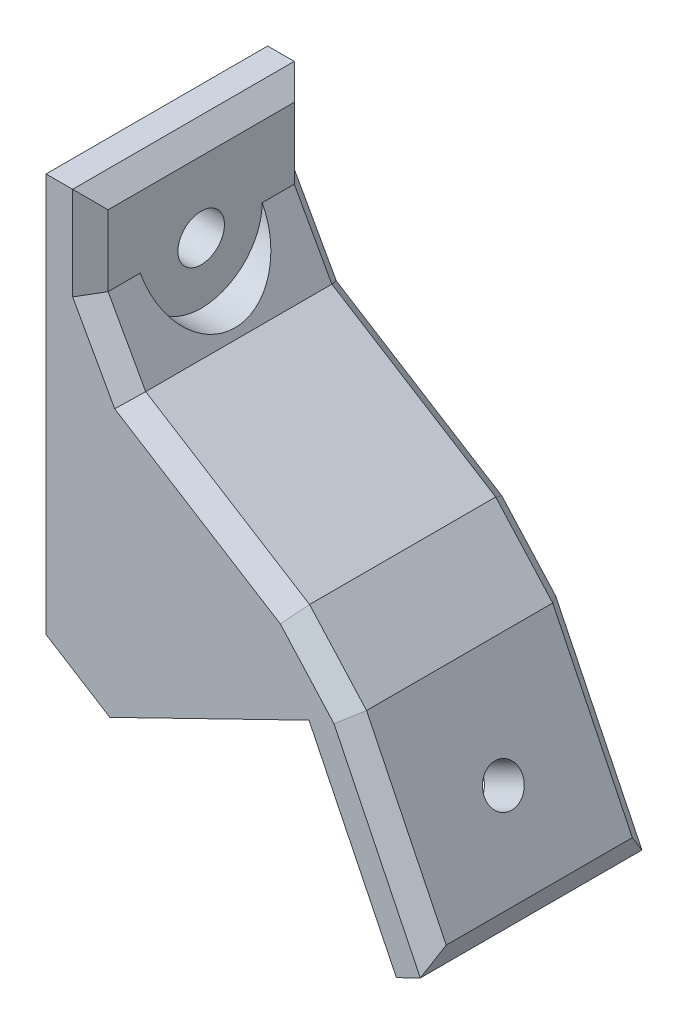
ISO-10303-21;
HEADER;
FILE_DESCRIPTION(('STEP AP214'),'2;1');
FILE_NAME('part.step','',(''),(''),'','','');
FILE_SCHEMA(('AUTOMOTIVE_DESIGN { 1 0 10303 214 1 1 1 1 }'));
ENDSEC;
DATA;
#1=APPLICATION_CONTEXT('core data for automotive mechanical design processes');
#2=APPLICATION_PROTOCOL_DEFINITION('international standard','automotive_design',2000,#1);
#3=PRODUCT_CONTEXT('',#1,'mechanical');
#4=PRODUCT('Part','Part','',(#3));
#5=PRODUCT_RELATED_PRODUCT_CATEGORY('part','',(#4));
#6=PRODUCT_DEFINITION_FORMATION('','',#4);
#7=PRODUCT_DEFINITION_CONTEXT('part definition',#1,'design');
#8=PRODUCT_DEFINITION('design','',#6,#7);
#9=PRODUCT_DEFINITION_SHAPE('','',#8);
#10=(LENGTH_UNIT() NAMED_UNIT(*) SI_UNIT(.MILLI.,.METRE.));
#11=(NAMED_UNIT(*) PLANE_ANGLE_UNIT() SI_UNIT($,.RADIAN.));
#12=(NAMED_UNIT(*) SI_UNIT($,.STERADIAN.) SOLID_ANGLE_UNIT());
#13=UNCERTAINTY_MEASURE_WITH_UNIT(LENGTH_MEASURE(1.E-05),#10,'distance_accuracy_value','');
#14=(GEOMETRIC_REPRESENTATION_CONTEXT(3) GLOBAL_UNCERTAINTY_ASSIGNED_CONTEXT((#13)) GLOBAL_UNIT_ASSIGNED_CONTEXT((#10,
#11,#12)) REPRESENTATION_CONTEXT('',''));
#15=CARTESIAN_POINT('',(0.,0.,0.));
#16=DIRECTION('',(0.,0.,1.));
#17=DIRECTION('',(1.,0.,0.));
#18=AXIS2_PLACEMENT_3D('',#15,#16,#17);
#19=CARTESIAN_POINT('',(3.39219238462569,21.8803229430672,0.));
#20=DIRECTION('',(0.874619707139395,0.484809620246338,0.));
#21=DIRECTION('',(0.,0.,-1.));
#22=AXIS2_PLACEMENT_3D('',#19,#20,#21);
#23=PLANE('',#22);
#24=DIRECTION('',(0.,0.,1.));
#25=VECTOR('',#24,1.);
#26=CARTESIAN_POINT('',(3.39219238462569,21.8803229430672,20.));
#27=LINE('',#26,#25);
#28=CARTESIAN_POINT('',(3.39219238462569,21.8803229430672,1.60000000000001));
#29=VERTEX_POINT('',#28);
#30=CARTESIAN_POINT('',(3.39219238462569,21.8803229430672,18.4));
#31=VERTEX_POINT('',#30);
#32=EDGE_CURVE('E367',#29,#31,#27,.T.);
#33=ORIENTED_EDGE('',*,*,#32,.F.);
#34=DIRECTION('',(0.484809620246338,-0.874619707139395,0.));
#35=VECTOR('',#34,1.);
#36=CARTESIAN_POINT('',(0.,28.,1.60000000000001));
#37=LINE('',#36,#35);
#38=CARTESIAN_POINT('',(0.,28.,1.60000000000001));
#39=VERTEX_POINT('',#38);
#40=EDGE_CURVE('E258',#29,#39,#37,.F.);
#41=ORIENTED_EDGE('',*,*,#40,.T.);
#42=DIRECTION('',(0.,0.,-1.));
#43=VECTOR('',#42,1.);
#44=CARTESIAN_POINT('',(0.,28.,0.));
#45=LINE('',#44,#43);
#46=CARTESIAN_POINT('',(0.,28.,4.5));
#47=VERTEX_POINT('',#46);
#48=EDGE_CURVE('E212',#47,#39,#45,.T.);
#49=ORIENTED_EDGE('',*,*,#48,.F.);
#50=CARTESIAN_POINT('',(0.,28.,10.));
#51=DIRECTION('',(0.874619707139395,0.484809620246338,0.));
#52=DIRECTION('',(-0.484809620246338,0.874619707139395,0.));
#53=AXIS2_PLACEMENT_3D('',#50,#51,#52);
#54=ELLIPSE('',#53,6.28844737330327,5.5);
#55=CARTESIAN_POINT('',(0.,28.,15.5));
#56=VERTEX_POINT('',#55);
#57=EDGE_CURVE('E216',#56,#47,#54,.T.);
#58=ORIENTED_EDGE('',*,*,#57,.F.);
#59=CARTESIAN_POINT('',(0.,28.,18.4));
#60=VERTEX_POINT('',#59);
#61=EDGE_CURVE('E199',#60,#56,#45,.T.);
#62=ORIENTED_EDGE('',*,*,#61,.F.);
#63=DIRECTION('',(-0.484809620246338,0.874619707139395,0.));
#64=VECTOR('',#63,1.);
#65=CARTESIAN_POINT('',(3.39219238462569,21.8803229430672,18.4));
#66=LINE('',#65,#64);
#67=EDGE_CURVE('E256',#60,#31,#66,.F.);
#68=ORIENTED_EDGE('',*,*,#67,.T.);
#69=EDGE_LOOP('',(#33,#41,#49,#58,#62,#68));
#70=FACE_BOUND('',#69,.T.);
#71=ADVANCED_FACE('F73',(#70),#23,.T.);
#72=CARTESIAN_POINT('',(31.2152223405397,28.,10.));
#73=DIRECTION('',(-1.,0.,0.));
#74=DIRECTION('',(0.,0.,1.));
#75=AXIS2_PLACEMENT_3D('',#72,#73,#74);
#76=CYLINDRICAL_SURFACE('',#75,2.1);
#77=CARTESIAN_POINT('',(-4.,28.,10.));
#78=DIRECTION('',(-1.,0.,0.));
#79=DIRECTION('',(0.,0.,1.));
#80=AXIS2_PLACEMENT_3D('',#77,#78,#79);
#81=CIRCLE('',#80,2.1);
#82=CARTESIAN_POINT('',(-4.,28.,12.1));
#83=VERTEX_POINT('',#82);
#84=EDGE_CURVE('E217',#83,#83,#81,.T.);
#85=ORIENTED_EDGE('',*,*,#84,.T.);
#86=EDGE_LOOP('',(#85));
#87=FACE_BOUND('',#86,.T.);
#88=CARTESIAN_POINT('',(0.,28.,10.));
#89=DIRECTION('',(1.,0.,0.));
#90=DIRECTION('',(0.,1.,0.));
#91=AXIS2_PLACEMENT_3D('',#88,#89,#90);
#92=CIRCLE('',#91,2.1);
#93=CARTESIAN_POINT('',(0.,30.1,10.));
#94=VERTEX_POINT('',#93);
#95=EDGE_CURVE('E314',#94,#94,#92,.T.);
#96=ORIENTED_EDGE('',*,*,#95,.T.);
#97=EDGE_LOOP('',(#96));
#98=FACE_BOUND('',#97,.T.);
#99=ADVANCED_FACE('F427',(#87,#98),#76,.F.);
#100=CARTESIAN_POINT('',(0.,0.,20.));
#101=DIRECTION('',(0.,0.,-1.));
#102=DIRECTION('',(-1.,0.,0.));
#103=AXIS2_PLACEMENT_3D('',#100,#101,#102);
#104=PLANE('',#103);
#105=DIRECTION('',(-0.484809620246338,0.874619707139395,0.));
#106=VECTOR('',#105,1.);
#107=CARTESIAN_POINT('',(10.4732818147669,5.80543490834101,20.));
#108=LINE('',#107,#106);
#109=CARTESIAN_POINT('',(2.19340932177962,20.7427202932483,20.));
#110=VERTEX_POINT('',#109);
#111=CARTESIAN_POINT('',(-1.60000000000001,27.5862118650305,20.));
#112=VERTEX_POINT('',#111);
#113=EDGE_CURVE('E246',#110,#112,#108,.T.);
#114=ORIENTED_EDGE('',*,*,#113,.T.);
#115=DIRECTION('',(0.,1.,0.));
#116=VECTOR('',#115,1.);
#117=CARTESIAN_POINT('',(-1.60000000000001,36.,20.));
#118=LINE('',#117,#116);
#119=CARTESIAN_POINT('',(-1.60000000000001,36.,20.));
#120=VERTEX_POINT('',#119);
#121=EDGE_CURVE('E254',#112,#120,#118,.T.);
#122=ORIENTED_EDGE('',*,*,#121,.T.);
#123=DIRECTION('',(1.,0.,0.));
#124=VECTOR('',#123,1.);
#125=CARTESIAN_POINT('',(0.,36.,20.));
#126=LINE('',#125,#124);
#127=CARTESIAN_POINT('',(-4.,36.,20.));
#128=VERTEX_POINT('',#127);
#129=EDGE_CURVE('E327',#128,#120,#126,.T.);
#130=ORIENTED_EDGE('',*,*,#129,.F.);
#131=DIRECTION('',(0.,1.,0.));
#132=VECTOR('',#131,1.);
#133=CARTESIAN_POINT('',(-4.,20.,20.));
#134=LINE('',#133,#132);
#135=CARTESIAN_POINT('',(-4.,0.,20.));
#136=VERTEX_POINT('',#135);
#137=EDGE_CURVE('E362',#136,#128,#134,.T.);
#138=ORIENTED_EDGE('',*,*,#137,.F.);
#139=DIRECTION('',(0.848048096156427,-0.529919264233203,0.));
#140=VECTOR('',#139,1.);
#141=CARTESIAN_POINT('',(-4.,0.,20.));
#142=LINE('',#141,#140);
#143=CARTESIAN_POINT('',(1.75348458715633,-3.59517618519666,20.));
#144=VERTEX_POINT('',#143);
#145=EDGE_CURVE('E318',#136,#144,#142,.T.);
#146=ORIENTED_EDGE('',*,*,#145,.T.);
#147=DIRECTION('',(-0.898794046299165,-0.438371146789082,0.));
#148=VECTOR('',#147,1.);
#149=CARTESIAN_POINT('',(1.75348458715633,-3.59517618519666,20.));
#150=LINE('',#149,#148);
#151=CARTESIAN_POINT('',(19.7293655131396,5.17224675058497,20.));
#152=VERTEX_POINT('',#151);
#153=EDGE_CURVE('E353',#152,#144,#150,.T.);
#154=ORIENTED_EDGE('',*,*,#153,.F.);
#155=DIRECTION('',(-0.438371146789082,0.898794046299165,0.));
#156=VECTOR('',#155,1.);
#157=CARTESIAN_POINT('',(17.9758809259833,8.76742293578163,20.));
#158=LINE('',#157,#156);
#159=CARTESIAN_POINT('',(27.620046155343,-11.0060460828,20.));
#160=VERTEX_POINT('',#159);
#161=EDGE_CURVE('E321',#160,#152,#158,.T.);
#162=ORIENTED_EDGE('',*,*,#161,.F.);
#163=DIRECTION('',(0.898794046299166,0.438371146789081,0.));
#164=VECTOR('',#163,1.);
#165=CARTESIAN_POINT('',(9.64416522935976,-19.7734690185816,20.));
#166=LINE('',#165,#164);
#167=CARTESIAN_POINT('',(29.777151866461,-9.95395533050622,20.));
#168=VERTEX_POINT('',#167);
#169=EDGE_CURVE('E335',#160,#168,#166,.T.);
#170=ORIENTED_EDGE('',*,*,#169,.T.);
#171=DIRECTION('',(-0.43837114678908,0.898794046299166,0.));
#172=VECTOR('',#171,1.);
#173=CARTESIAN_POINT('',(21.8864712242576,6.22433750287874,20.));
#174=LINE('',#173,#172);
#175=CARTESIAN_POINT('',(21.9850456992643,6.02222987809086,20.));
#176=VERTEX_POINT('',#175);
#177=EDGE_CURVE('E252',#168,#176,#174,.T.);
#178=ORIENTED_EDGE('',*,*,#177,.T.);
#179=DIRECTION('',(-0.669130606358861,0.743144825477392,0.));
#180=VECTOR('',#179,1.);
#181=CARTESIAN_POINT('',(16.9898330057904,11.5699756096966,20.));
#182=LINE('',#181,#180);
#183=CARTESIAN_POINT('',(17.1402972840985,11.4028680991728,20.));
#184=VERTEX_POINT('',#183);
#185=EDGE_CURVE('E250',#176,#184,#182,.T.);
#186=ORIENTED_EDGE('',*,*,#185,.T.);
#187=DIRECTION('',(-0.848048096156428,0.529919264233203,0.));
#188=VECTOR('',#187,1.);
#189=CARTESIAN_POINT('',(2.54432156185256,20.5234459892169,20.));
#190=LINE('',#189,#188);
#191=EDGE_CURVE('E248',#184,#110,#190,.T.);
#192=ORIENTED_EDGE('',*,*,#191,.T.);
#193=EDGE_LOOP('',(#114,#122,#130,#138,#146,#154,#162,#170,#178,#186,#192));
#194=FACE_BOUND('',#193,.T.);
#195=ADVANCED_FACE('F432',(#194),#104,.F.);
#196=CARTESIAN_POINT('',(0.,0.,0.));
#197=DIRECTION('',(0.,0.,-1.));
#198=DIRECTION('',(-1.,0.,0.));
#199=AXIS2_PLACEMENT_3D('',#196,#197,#198);
#200=PLANE('',#199);
#201=DIRECTION('',(1.,0.,0.));
#202=VECTOR('',#201,1.);
#203=CARTESIAN_POINT('',(0.,36.,0.));
#204=LINE('',#203,#202);
#205=CARTESIAN_POINT('',(-4.,36.,0.));
#206=VERTEX_POINT('',#205);
#207=CARTESIAN_POINT('',(-1.60000000000002,36.,0.));
#208=VERTEX_POINT('',#207);
#209=EDGE_CURVE('E330',#206,#208,#204,.T.);
#210=ORIENTED_EDGE('',*,*,#209,.T.);
#211=DIRECTION('',(0.,-1.,0.));
#212=VECTOR('',#211,1.);
#213=CARTESIAN_POINT('',(-1.6,0.,0.));
#214=LINE('',#213,#212);
#215=CARTESIAN_POINT('',(-1.60000000000001,27.5862118650305,0.));
#216=VERTEX_POINT('',#215);
#217=EDGE_CURVE('E241',#208,#216,#214,.T.);
#218=ORIENTED_EDGE('',*,*,#217,.T.);
#219=DIRECTION('',(0.484809620246338,-0.874619707139395,0.));
#220=VECTOR('',#219,1.);
#221=CARTESIAN_POINT('',(1.99280085320265,21.104627550673,0.));
#222=LINE('',#221,#220);
#223=CARTESIAN_POINT('',(2.19340932177963,20.7427202932483,0.));
#224=VERTEX_POINT('',#223);
#225=EDGE_CURVE('E239',#216,#224,#222,.T.);
#226=ORIENTED_EDGE('',*,*,#225,.T.);
#227=DIRECTION('',(0.848048096156428,-0.529919264233203,0.));
#228=VECTOR('',#227,1.);
#229=CARTESIAN_POINT('',(9.93765773281683,15.9035768076187,0.));
#230=LINE('',#229,#228);
#231=CARTESIAN_POINT('',(17.1402972840985,11.4028680991728,0.));
#232=VERTEX_POINT('',#231);
#233=EDGE_CURVE('E237',#224,#232,#230,.T.);
#234=ORIENTED_EDGE('',*,*,#233,.T.);
#235=DIRECTION('',(0.669130606358861,-0.743144825477392,0.));
#236=VECTOR('',#235,1.);
#237=CARTESIAN_POINT('',(15.1361741068899,13.62867238104,0.));
#238=LINE('',#237,#236);
#239=CARTESIAN_POINT('',(21.9850456992643,6.02222987809087,0.));
#240=VERTEX_POINT('',#239);
#241=EDGE_CURVE('E235',#232,#240,#238,.T.);
#242=ORIENTED_EDGE('',*,*,#241,.T.);
#243=DIRECTION('',(0.43837114678908,-0.898794046299166,0.));
#244=VECTOR('',#243,1.);
#245=CARTESIAN_POINT('',(20.1329866371013,9.81951368807538,0.));
#246=LINE('',#245,#244);
#247=CARTESIAN_POINT('',(29.777151866461,-9.95395533050622,0.));
#248=VERTEX_POINT('',#247);
#249=EDGE_CURVE('E233',#240,#248,#246,.T.);
#250=ORIENTED_EDGE('',*,*,#249,.T.);
#251=DIRECTION('',(0.898794046299166,0.438371146789081,0.));
#252=VECTOR('',#251,1.);
#253=CARTESIAN_POINT('',(9.64416522935976,-19.7734690185816,0.));
#254=LINE('',#253,#252);
#255=CARTESIAN_POINT('',(27.620046155343,-11.0060460828,0.));
#256=VERTEX_POINT('',#255);
#257=EDGE_CURVE('E326',#256,#248,#254,.T.);
#258=ORIENTED_EDGE('',*,*,#257,.F.);
#259=DIRECTION('',(-0.438371146789082,0.898794046299165,0.));
#260=VECTOR('',#259,1.);
#261=CARTESIAN_POINT('',(17.9758809259833,8.76742293578163,0.));
#262=LINE('',#261,#260);
#263=CARTESIAN_POINT('',(19.7293655131396,5.17224675058497,0.));
#264=VERTEX_POINT('',#263);
#265=EDGE_CURVE('E323',#256,#264,#262,.T.);
#266=ORIENTED_EDGE('',*,*,#265,.T.);
#267=DIRECTION('',(0.898794046299165,0.438371146789082,0.));
#268=VECTOR('',#267,1.);
#269=CARTESIAN_POINT('',(1.75348458715633,-3.59517618519666,0.));
#270=LINE('',#269,#268);
#271=CARTESIAN_POINT('',(1.75348458715633,-3.59517618519666,0.));
#272=VERTEX_POINT('',#271);
#273=EDGE_CURVE('E347',#272,#264,#270,.T.);
#274=ORIENTED_EDGE('',*,*,#273,.F.);
#275=DIRECTION('',(0.848048096156427,-0.529919264233203,0.));
#276=VECTOR('',#275,1.);
#277=CARTESIAN_POINT('',(-4.,0.,0.));
#278=LINE('',#277,#276);
#279=CARTESIAN_POINT('',(-4.,0.,0.));
#280=VERTEX_POINT('',#279);
#281=EDGE_CURVE('E317',#280,#272,#278,.T.);
#282=ORIENTED_EDGE('',*,*,#281,.F.);
#283=DIRECTION('',(0.,-1.,0.));
#284=VECTOR('',#283,1.);
#285=CARTESIAN_POINT('',(-4.,20.,0.));
#286=LINE('',#285,#284);
#287=EDGE_CURVE('E356',#206,#280,#286,.T.);
#288=ORIENTED_EDGE('',*,*,#287,.F.);
#289=EDGE_LOOP('',(#210,#218,#226,#234,#242,#250,#258,#266,#274,#282,#288));
#290=FACE_BOUND('',#289,.T.);
#291=ADVANCED_FACE('F402',(#290),#200,.T.);
#292=CARTESIAN_POINT('',(-4.,0.,0.));
#293=DIRECTION('',(-1.,0.,0.));
#294=DIRECTION('',(0.,0.,1.));
#295=AXIS2_PLACEMENT_3D('',#292,#293,#294);
#296=PLANE('',#295);
#297=ORIENTED_EDGE('',*,*,#84,.F.);
#298=EDGE_LOOP('',(#297));
#299=FACE_BOUND('',#298,.T.);
#300=ORIENTED_EDGE('',*,*,#287,.T.);
#301=DIRECTION('',(0.,0.,1.));
#302=VECTOR('',#301,1.);
#303=CARTESIAN_POINT('',(-4.,0.,0.));
#304=LINE('',#303,#302);
#305=EDGE_CURVE('E359',#280,#136,#304,.T.);
#306=ORIENTED_EDGE('',*,*,#305,.T.);
#307=ORIENTED_EDGE('',*,*,#137,.T.);
#308=DIRECTION('',(0.,0.,1.));
#309=VECTOR('',#308,1.);
#310=CARTESIAN_POINT('',(-4.,36.,0.));
#311=LINE('',#310,#309);
#312=EDGE_CURVE('E340',#206,#128,#311,.T.);
#313=ORIENTED_EDGE('',*,*,#312,.F.);
#314=EDGE_LOOP('',(#300,#306,#307,#313));
#315=FACE_BOUND('',#314,.T.);
#316=ADVANCED_FACE('F634',(#299,#315),#296,.T.);
#317=CARTESIAN_POINT('',(1.75348458715633,-3.59517618519666,0.));
#318=DIRECTION('',(0.438371146789082,-0.898794046299165,0.));
#319=DIRECTION('',(0.898794046299165,0.438371146789082,0.));
#320=AXIS2_PLACEMENT_3D('',#317,#318,#319);
#321=PLANE('',#320);
#322=DIRECTION('',(0.,0.,-1.));
#323=VECTOR('',#322,1.);
#324=CARTESIAN_POINT('',(1.75348458715633,-3.59517618519666,20.));
#325=LINE('',#324,#323);
#326=EDGE_CURVE('E343',#144,#272,#325,.T.);
#327=ORIENTED_EDGE('',*,*,#326,.T.);
#328=ORIENTED_EDGE('',*,*,#273,.T.);
#329=DIRECTION('',(0.,0.,1.));
#330=VECTOR('',#329,1.);
#331=CARTESIAN_POINT('',(19.7293655131396,5.17224675058497,20.));
#332=LINE('',#331,#330);
#333=EDGE_CURVE('E350',#264,#152,#332,.T.);
#334=ORIENTED_EDGE('',*,*,#333,.T.);
#335=ORIENTED_EDGE('',*,*,#153,.T.);
#336=EDGE_LOOP('',(#327,#328,#334,#335));
#337=FACE_BOUND('',#336,.T.);
#338=ADVANCED_FACE('F627',(#337),#321,.T.);
#339=CARTESIAN_POINT('',(0.,36.,0.));
#340=DIRECTION('',(0.,-1.,0.));
#341=DIRECTION('',(0.,0.,-1.));
#342=AXIS2_PLACEMENT_3D('',#339,#340,#341);
#343=PLANE('',#342);
#344=ORIENTED_EDGE('',*,*,#129,.T.);
#345=DIRECTION('',(0.,0.,-1.));
#346=VECTOR('',#345,1.);
#347=CARTESIAN_POINT('',(-1.60000000000002,36.,0.));
#348=LINE('',#347,#346);
#349=EDGE_CURVE('E244',#120,#208,#348,.T.);
#350=ORIENTED_EDGE('',*,*,#349,.T.);
#351=ORIENTED_EDGE('',*,*,#209,.F.);
#352=ORIENTED_EDGE('',*,*,#312,.T.);
#353=EDGE_LOOP('',(#344,#350,#351,#352));
#354=FACE_BOUND('',#353,.T.);
#355=ADVANCED_FACE('F556',(#354),#343,.F.);
#356=CARTESIAN_POINT('',(0.,0.,0.));
#357=DIRECTION('',(1.,0.,0.));
#358=DIRECTION('',(0.,1.,0.));
#359=AXIS2_PLACEMENT_3D('',#356,#357,#358);
#360=PLANE('',#359);
#361=ORIENTED_EDGE('',*,*,#48,.T.);
#362=DIRECTION('',(0.,1.,0.));
#363=VECTOR('',#362,1.);
#364=CARTESIAN_POINT('',(0.,0.,1.60000000000001));
#365=LINE('',#364,#363);
#366=CARTESIAN_POINT('',(0.,34.4,1.60000000000001));
#367=VERTEX_POINT('',#366);
#368=EDGE_CURVE('E230',#39,#367,#365,.T.);
#369=ORIENTED_EDGE('',*,*,#368,.T.);
#370=DIRECTION('',(0.,0.,1.));
#371=VECTOR('',#370,1.);
#372=CARTESIAN_POINT('',(0.,34.4,20.));
#373=LINE('',#372,#371);
#374=CARTESIAN_POINT('',(0.,34.4,18.4));
#375=VERTEX_POINT('',#374);
#376=EDGE_CURVE('E222',#367,#375,#373,.T.);
#377=ORIENTED_EDGE('',*,*,#376,.T.);
#378=DIRECTION('',(0.,-1.,0.));
#379=VECTOR('',#378,1.);
#380=CARTESIAN_POINT('',(0.,28.,18.4));
#381=LINE('',#380,#379);
#382=EDGE_CURVE('E207',#375,#60,#381,.T.);
#383=ORIENTED_EDGE('',*,*,#382,.T.);
#384=ORIENTED_EDGE('',*,*,#61,.T.);
#385=CARTESIAN_POINT('',(0.,28.,10.));
#386=DIRECTION('',(1.,0.,0.));
#387=DIRECTION('',(0.,1.,0.));
#388=AXIS2_PLACEMENT_3D('',#385,#386,#387);
#389=CIRCLE('',#388,5.5);
#390=EDGE_CURVE('E204',#56,#47,#389,.T.);
#391=ORIENTED_EDGE('',*,*,#390,.T.);
#392=EDGE_LOOP('',(#361,#369,#377,#383,#384,#391));
#393=FACE_BOUND('',#392,.T.);
#394=ORIENTED_EDGE('',*,*,#95,.F.);
#395=EDGE_LOOP('',(#394));
#396=FACE_BOUND('',#395,.T.);
#397=ADVANCED_FACE('F202',(#393,#396),#360,.T.);
#398=CARTESIAN_POINT('',(10.78552855559,17.260453761469,0.));
#399=DIRECTION('',(0.529919264233203,0.848048096156428,0.));
#400=DIRECTION('',(-0.848048096156428,0.529919264233203,0.));
#401=AXIS2_PLACEMENT_3D('',#398,#399,#400);
#402=PLANE('',#401);
#403=DIRECTION('',(0.,0.,-1.));
#404=VECTOR('',#403,1.);
#405=CARTESIAN_POINT('',(18.1788647265542,12.6405845798708,0.));
#406=LINE('',#405,#404);
#407=CARTESIAN_POINT('',(18.1788647265542,12.6405845798708,18.4));
#408=VERTEX_POINT('',#407);
#409=CARTESIAN_POINT('',(18.1788647265542,12.6405845798708,1.60000000000001));
#410=VERTEX_POINT('',#409);
#411=EDGE_CURVE('E364',#408,#410,#406,.T.);
#412=ORIENTED_EDGE('',*,*,#411,.T.);
#413=DIRECTION('',(-0.848048096156428,0.529919264233203,0.));
#414=VECTOR('',#413,1.);
#415=CARTESIAN_POINT('',(10.78552855559,17.260453761469,1.60000000000001));
#416=LINE('',#415,#414);
#417=EDGE_CURVE('E262',#410,#29,#416,.T.);
#418=ORIENTED_EDGE('',*,*,#417,.T.);
#419=ORIENTED_EDGE('',*,*,#32,.T.);
#420=DIRECTION('',(0.848048096156428,-0.529919264233203,0.));
#421=VECTOR('',#420,1.);
#422=CARTESIAN_POINT('',(18.1788647265542,12.6405845798708,18.4));
#423=LINE('',#422,#421);
#424=EDGE_CURVE('E260',#31,#408,#423,.T.);
#425=ORIENTED_EDGE('',*,*,#424,.T.);
#426=EDGE_LOOP('',(#412,#418,#419,#425));
#427=FACE_BOUND('',#426,.T.);
#428=ADVANCED_FACE('F555',(#427),#402,.T.);
#429=CARTESIAN_POINT('',(21.57105711118,10.5209075229379,0.));
#430=DIRECTION('',(0.898794046299166,0.43837114678908,0.));
#431=DIRECTION('',(-0.43837114678908,0.898794046299166,0.));
#432=AXIS2_PLACEMENT_3D('',#429,#430,#431);
#433=PLANE('',#432);
#434=CARTESIAN_POINT('',(27.269882019438,-1.16341507895126,10.));
#435=DIRECTION('',(0.898794046299166,0.43837114678908,0.));
#436=DIRECTION('',(-0.43837114678908,0.898794046299166,0.));
#437=AXIS2_PLACEMENT_3D('',#434,#435,#436);
#438=CIRCLE('',#437,1.7272);
#439=CARTESIAN_POINT('',(26.5127273747039,0.388981997816653,10.));
#440=VERTEX_POINT('',#439);
#441=EDGE_CURVE('E227',#440,#440,#438,.T.);
#442=ORIENTED_EDGE('',*,*,#441,.F.);
#443=EDGE_LOOP('',(#442));
#444=FACE_BOUND('',#443,.T.);
#445=DIRECTION('',(0.,0.,-1.));
#446=VECTOR('',#445,1.);
#447=CARTESIAN_POINT('',(30.5138285056772,-7.81449102156502,0.));
#448=LINE('',#447,#446);
#449=CARTESIAN_POINT('',(30.5138285056772,-7.81449102156502,18.4));
#450=VERTEX_POINT('',#449);
#451=CARTESIAN_POINT('',(30.5138285056772,-7.81449102156502,1.60000000000001));
#452=VERTEX_POINT('',#451);
#453=EDGE_CURVE('E90',#450,#452,#448,.T.);
#454=ORIENTED_EDGE('',*,*,#453,.T.);
#455=DIRECTION('',(-0.43837114678908,0.898794046299166,0.));
#456=VECTOR('',#455,1.);
#457=CARTESIAN_POINT('',(21.57105711118,10.5209075229379,1.60000000000001));
#458=LINE('',#457,#456);
#459=CARTESIAN_POINT('',(23.3245416983363,6.92573133774126,1.60000000000001));
#460=VERTEX_POINT('',#459);
#461=EDGE_CURVE('E82',#452,#460,#458,.T.);
#462=ORIENTED_EDGE('',*,*,#461,.T.);
#463=DIRECTION('',(0.,0.,1.));
#464=VECTOR('',#463,1.);
#465=CARTESIAN_POINT('',(23.3245416983363,6.92573133774126,0.));
#466=LINE('',#465,#464);
#467=CARTESIAN_POINT('',(23.3245416983363,6.92573133774126,18.4));
#468=VERTEX_POINT('',#467);
#469=EDGE_CURVE('E211',#460,#468,#466,.T.);
#470=ORIENTED_EDGE('',*,*,#469,.T.);
#471=DIRECTION('',(0.43837114678908,-0.898794046299166,0.));
#472=VECTOR('',#471,1.);
#473=CARTESIAN_POINT('',(31.2152223405397,-9.25256149564369,18.4));
#474=LINE('',#473,#472);
#475=EDGE_CURVE('E95',#468,#450,#474,.T.);
#476=ORIENTED_EDGE('',*,*,#475,.T.);
#477=EDGE_LOOP('',(#454,#462,#470,#476));
#478=FACE_BOUND('',#477,.T.);
#479=ADVANCED_FACE('F609',(#444,#478),#433,.T.);
#480=CARTESIAN_POINT('',(9.64416522935976,-19.7734690185816,0.));
#481=DIRECTION('',(0.438371146789081,-0.898794046299166,0.));
#482=DIRECTION('',(0.898794046299166,0.438371146789081,0.));
#483=AXIS2_PLACEMENT_3D('',#480,#481,#482);
#484=PLANE('',#483);
#485=ORIENTED_EDGE('',*,*,#257,.T.);
#486=DIRECTION('',(0.,0.,1.));
#487=VECTOR('',#486,1.);
#488=CARTESIAN_POINT('',(29.777151866461,-9.95395533050623,0.));
#489=LINE('',#488,#487);
#490=EDGE_CURVE('E12',#248,#168,#489,.T.);
#491=ORIENTED_EDGE('',*,*,#490,.T.);
#492=ORIENTED_EDGE('',*,*,#169,.F.);
#493=DIRECTION('',(0.,0.,1.));
#494=VECTOR('',#493,1.);
#495=CARTESIAN_POINT('',(27.620046155343,-11.0060460828,0.));
#496=LINE('',#495,#494);
#497=EDGE_CURVE('E333',#256,#160,#496,.T.);
#498=ORIENTED_EDGE('',*,*,#497,.F.);
#499=EDGE_LOOP('',(#485,#491,#492,#498));
#500=FACE_BOUND('',#499,.T.);
#501=ADVANCED_FACE('F413',(#500),#484,.T.);
#502=CARTESIAN_POINT('',(17.9758809259833,8.76742293578163,0.));
#503=DIRECTION('',(0.898794046299165,0.438371146789082,0.));
#504=DIRECTION('',(-0.438371146789082,0.898794046299165,0.));
#505=AXIS2_PLACEMENT_3D('',#502,#503,#504);
#506=PLANE('',#505);
#507=CARTESIAN_POINT('',(23.6747058342414,-2.91689966610757,10.));
#508=DIRECTION('',(0.898794046299165,0.438371146789082,0.));
#509=DIRECTION('',(-0.438371146789082,0.898794046299165,0.));
#510=AXIS2_PLACEMENT_3D('',#507,#508,#509);
#511=CIRCLE('',#510,1.7272);
#512=CARTESIAN_POINT('',(22.9175511895073,-1.36450258933966,10.));
#513=VERTEX_POINT('',#512);
#514=EDGE_CURVE('E218',#513,#513,#511,.T.);
#515=ORIENTED_EDGE('',*,*,#514,.T.);
#516=EDGE_LOOP('',(#515));
#517=FACE_BOUND('',#516,.T.);
#518=ORIENTED_EDGE('',*,*,#333,.F.);
#519=ORIENTED_EDGE('',*,*,#265,.F.);
#520=ORIENTED_EDGE('',*,*,#497,.T.);
#521=ORIENTED_EDGE('',*,*,#161,.T.);
#522=EDGE_LOOP('',(#518,#519,#520,#521));
#523=FACE_BOUND('',#522,.T.);
#524=ADVANCED_FACE('F585',(#517,#523),#506,.F.);
#525=CARTESIAN_POINT('',(-4.,0.,0.));
#526=DIRECTION('',(-0.529919264233203,-0.848048096156427,0.));
#527=DIRECTION('',(0.848048096156427,-0.529919264233203,0.));
#528=AXIS2_PLACEMENT_3D('',#525,#526,#527);
#529=PLANE('',#528);
#530=ORIENTED_EDGE('',*,*,#145,.F.);
#531=ORIENTED_EDGE('',*,*,#305,.F.);
#532=ORIENTED_EDGE('',*,*,#281,.T.);
#533=ORIENTED_EDGE('',*,*,#326,.F.);
#534=EDGE_LOOP('',(#530,#531,#532,#533));
#535=FACE_BOUND('',#534,.T.);
#536=ADVANCED_FACE('F441',(#535),#529,.T.);
#537=CARTESIAN_POINT('',(23.3245416983363,6.92573133774126,0.));
#538=DIRECTION('',(-0.743144825477392,-0.669130606358861,0.));
#539=DIRECTION('',(0.,0.,1.));
#540=AXIS2_PLACEMENT_3D('',#537,#538,#539);
#541=PLANE('',#540);
#542=ORIENTED_EDGE('',*,*,#469,.F.);
#543=DIRECTION('',(0.669130606358861,-0.743144825477392,0.));
#544=VECTOR('',#543,1.);
#545=CARTESIAN_POINT('',(23.3245416983363,6.92573133774126,1.60000000000001));
#546=LINE('',#545,#544);
#547=EDGE_CURVE('E266',#460,#410,#546,.F.);
#548=ORIENTED_EDGE('',*,*,#547,.T.);
#549=ORIENTED_EDGE('',*,*,#411,.F.);
#550=DIRECTION('',(-0.669130606358861,0.743144825477392,0.));
#551=VECTOR('',#550,1.);
#552=CARTESIAN_POINT('',(23.3245416983363,6.92573133774127,18.4));
#553=LINE('',#552,#551);
#554=EDGE_CURVE('E264',#408,#468,#553,.F.);
#555=ORIENTED_EDGE('',*,*,#554,.T.);
#556=EDGE_LOOP('',(#542,#548,#549,#555));
#557=FACE_BOUND('',#556,.T.);
#558=ADVANCED_FACE('F438',(#557),#541,.F.);
#559=CARTESIAN_POINT('',(31.2152223405397,28.,10.));
#560=DIRECTION('',(-1.,0.,0.));
#561=DIRECTION('',(0.,-1.,0.));
#562=AXIS2_PLACEMENT_3D('',#559,#560,#561);
#563=CYLINDRICAL_SURFACE('',#562,5.5);
#564=ORIENTED_EDGE('',*,*,#57,.T.);
#565=ORIENTED_EDGE('',*,*,#390,.F.);
#566=EDGE_LOOP('',(#564,#565));
#567=FACE_BOUND('',#566,.T.);
#568=ADVANCED_FACE('F215',(#567),#563,.F.);
#569=CARTESIAN_POINT('',(27.269882019438,-1.16341507895126,10.));
#570=DIRECTION('',(0.898794046299166,0.43837114678908,0.));
#571=DIRECTION('',(-0.43837114678908,0.898794046299166,0.));
#572=AXIS2_PLACEMENT_3D('',#569,#570,#571);
#573=CYLINDRICAL_SURFACE('',#572,1.7272);
#574=ORIENTED_EDGE('',*,*,#441,.T.);
#575=EDGE_LOOP('',(#574));
#576=FACE_BOUND('',#575,.T.);
#577=ORIENTED_EDGE('',*,*,#514,.F.);
#578=EDGE_LOOP('',(#577));
#579=FACE_BOUND('',#578,.T.);
#580=ADVANCED_FACE('F424',(#576,#579),#573,.F.);
#581=CARTESIAN_POINT('',(20.1329866371013,9.81951368807538,20.));
#582=DIRECTION('',(0.635543365028237,0.309975210571083,0.707106781186546));
#583=DIRECTION('',(0.43837114678908,-0.898794046299166,0.));
#584=AXIS2_PLACEMENT_3D('',#581,#582,#583);
#585=PLANE('',#584);
#586=DIRECTION('',(-0.589077512303551,-0.397337799129095,0.703640787534028));
#587=VECTOR('',#586,1.);
#588=CARTESIAN_POINT('',(21.3887878525955,5.62004888227862,20.7122175469961));
#589=LINE('',#588,#587);
#590=EDGE_CURVE('E298',#176,#468,#589,.F.);
#591=ORIENTED_EDGE('',*,*,#590,.F.);
#592=ORIENTED_EDGE('',*,*,#177,.F.);
#593=DIRECTION('',(-0.265825284973214,-0.772012684180496,0.577350269189627));
#594=VECTOR('',#593,1.);
#595=CARTESIAN_POINT('',(33.1535864628683,-0.148077247859099,12.6666666666667));
#596=LINE('',#595,#594);
#597=EDGE_CURVE('E77',#450,#168,#596,.T.);
#598=ORIENTED_EDGE('',*,*,#597,.F.);
#599=ORIENTED_EDGE('',*,*,#475,.F.);
#600=EDGE_LOOP('',(#591,#592,#598,#599));
#601=FACE_BOUND('',#600,.T.);
#602=ADVANCED_FACE('F75',(#601),#585,.T.);
#603=CARTESIAN_POINT('',(29.777151866461,-9.95395533050622,0.));
#604=DIRECTION('',(-0.945518575599318,0.325568154457152,0.));
#605=DIRECTION('',(0.,0.,1.));
#606=AXIS2_PLACEMENT_3D('',#603,#604,#605);
#607=PLANE('',#606);
#608=ORIENTED_EDGE('',*,*,#597,.T.);
#609=ORIENTED_EDGE('',*,*,#490,.F.);
#610=DIRECTION('',(0.265825284973215,0.772012684180498,0.577350269189625));
#611=VECTOR('',#610,1.);
#612=CARTESIAN_POINT('',(29.777151866461,-9.95395533050623,0.));
#613=LINE('',#612,#611);
#614=EDGE_CURVE('E296',#452,#248,#613,.F.);
#615=ORIENTED_EDGE('',*,*,#614,.F.);
#616=ORIENTED_EDGE('',*,*,#453,.F.);
#617=EDGE_LOOP('',(#608,#609,#615,#616));
#618=FACE_BOUND('',#617,.T.);
#619=ADVANCED_FACE('F416',(#618),#607,.F.);
#620=CARTESIAN_POINT('',(15.1361741068899,13.62867238104,20.));
#621=DIRECTION('',(-0.525482745498759,-0.473146789255818,-0.707106781186546));
#622=DIRECTION('',(-0.669130606358861,0.743144825477392,0.));
#623=AXIS2_PLACEMENT_3D('',#620,#621,#622);
#624=PLANE('',#623);
#625=ORIENTED_EDGE('',*,*,#590,.T.);
#626=ORIENTED_EDGE('',*,*,#554,.F.);
#627=DIRECTION('',(-0.456736508197943,-0.544317374513843,0.703640787534028));
#628=VECTOR('',#627,1.);
#629=CARTESIAN_POINT('',(16.7566868071031,10.9456989350567,20.5909840209717));
#630=LINE('',#629,#628);
#631=EDGE_CURVE('E293',#184,#408,#630,.F.);
#632=ORIENTED_EDGE('',*,*,#631,.F.);
#633=ORIENTED_EDGE('',*,*,#185,.F.);
#634=EDGE_LOOP('',(#625,#626,#632,#633));
#635=FACE_BOUND('',#634,.T.);
#636=ADVANCED_FACE('F418',(#635),#624,.F.);
#637=CARTESIAN_POINT('',(21.57105711118,10.5209075229379,1.60000000000001));
#638=DIRECTION('',(-0.635543365028235,-0.309975210571082,0.707106781186548));
#639=DIRECTION('',(-0.43837114678908,0.898794046299166,0.));
#640=AXIS2_PLACEMENT_3D('',#637,#638,#639);
#641=PLANE('',#640);
#642=ORIENTED_EDGE('',*,*,#614,.T.);
#643=ORIENTED_EDGE('',*,*,#249,.F.);
#644=DIRECTION('',(-0.58907751230356,-0.397337799129083,-0.703640787534027));
#645=VECTOR('',#644,1.);
#646=CARTESIAN_POINT('',(23.5575578202515,7.08290269653467,1.87833289186583));
#647=LINE('',#646,#645);
#648=EDGE_CURVE('E290',#460,#240,#647,.T.);
#649=ORIENTED_EDGE('',*,*,#648,.F.);
#650=ORIENTED_EDGE('',*,*,#461,.F.);
#651=EDGE_LOOP('',(#642,#643,#649,#650));
#652=FACE_BOUND('',#651,.T.);
#653=ADVANCED_FACE('F410',(#652),#641,.F.);
#654=CARTESIAN_POINT('',(9.93765773281684,15.9035768076187,20.));
#655=DIRECTION('',(0.374709505220684,0.599660559564552,0.707106781186546));
#656=DIRECTION('',(0.848048096156428,-0.529919264233203,0.));
#657=AXIS2_PLACEMENT_3D('',#654,#655,#656);
#658=PLANE('',#657);
#659=ORIENTED_EDGE('',*,*,#631,.T.);
#660=ORIENTED_EDGE('',*,*,#424,.F.);
#661=DIRECTION('',(0.521149905430142,0.494552794200019,-0.695571930010914));
#662=VECTOR('',#661,1.);
#663=CARTESIAN_POINT('',(3.04950351942042,21.5551233525796,18.8573823248943));
#664=LINE('',#663,#662);
#665=EDGE_CURVE('E287',#110,#31,#664,.T.);
#666=ORIENTED_EDGE('',*,*,#665,.F.);
#667=ORIENTED_EDGE('',*,*,#191,.F.);
#668=EDGE_LOOP('',(#659,#660,#666,#667));
#669=FACE_BOUND('',#668,.T.);
#670=ADVANCED_FACE('F457',(#669),#658,.T.);
#671=CARTESIAN_POINT('',(15.1361741068899,13.62867238104,0.));
#672=DIRECTION('',(0.525482745498759,0.473146789255818,-0.707106781186546));
#673=DIRECTION('',(-0.669130606358861,0.743144825477392,0.));
#674=AXIS2_PLACEMENT_3D('',#671,#672,#673);
#675=PLANE('',#674);
#676=ORIENTED_EDGE('',*,*,#648,.T.);
#677=ORIENTED_EDGE('',*,*,#241,.F.);
#678=DIRECTION('',(-0.456736508197928,-0.544317374513857,-0.703640787534027));
#679=VECTOR('',#678,1.);
#680=CARTESIAN_POINT('',(17.2755770295276,11.5640882217931,0.208409761213669));
#681=LINE('',#680,#679);
#682=EDGE_CURVE('E284',#410,#232,#681,.T.);
#683=ORIENTED_EDGE('',*,*,#682,.F.);
#684=ORIENTED_EDGE('',*,*,#547,.F.);
#685=EDGE_LOOP('',(#676,#677,#683,#684));
#686=FACE_BOUND('',#685,.T.);
#687=ADVANCED_FACE('F405',(#686),#675,.T.);
#688=CARTESIAN_POINT('',(10.4732818147669,5.80543490834101,20.));
#689=DIRECTION('',(0.61844952587766,0.342812170060662,0.707106781186546));
#690=DIRECTION('',(0.484809620246338,-0.874619707139395,0.));
#691=AXIS2_PLACEMENT_3D('',#688,#689,#690);
#692=PLANE('',#691);
#693=ORIENTED_EDGE('',*,*,#665,.T.);
#694=ORIENTED_EDGE('',*,*,#67,.F.);
#695=DIRECTION('',(-0.695571930010912,-0.179887132285185,0.695571930010914));
#696=VECTOR('',#695,1.);
#697=CARTESIAN_POINT('',(-5.0517093054777,26.6935391425492,23.4517093054777));
#698=LINE('',#697,#696);
#699=EDGE_CURVE('E281',#112,#60,#698,.F.);
#700=ORIENTED_EDGE('',*,*,#699,.F.);
#701=ORIENTED_EDGE('',*,*,#113,.F.);
#702=EDGE_LOOP('',(#693,#694,#700,#701));
#703=FACE_BOUND('',#702,.T.);
#704=ADVANCED_FACE('F392',(#703),#692,.T.);
#705=CARTESIAN_POINT('',(10.78552855559,17.260453761469,1.60000000000001));
#706=DIRECTION('',(-0.374709505220683,-0.59966055956455,0.707106781186549));
#707=DIRECTION('',(-0.848048096156428,0.529919264233203,0.));
#708=AXIS2_PLACEMENT_3D('',#705,#706,#707);
#709=PLANE('',#708);
#710=ORIENTED_EDGE('',*,*,#682,.T.);
#711=ORIENTED_EDGE('',*,*,#233,.F.);
#712=DIRECTION('',(0.521149905430135,0.494552794200028,0.695571930010912));
#713=VECTOR('',#712,1.);
#714=CARTESIAN_POINT('',(0.592321399391176,19.2233445867064,-2.13695100908389));
#715=LINE('',#714,#713);
#716=EDGE_CURVE('E278',#29,#224,#715,.F.);
#717=ORIENTED_EDGE('',*,*,#716,.F.);
#718=ORIENTED_EDGE('',*,*,#417,.F.);
#719=EDGE_LOOP('',(#710,#711,#717,#718));
#720=FACE_BOUND('',#719,.T.);
#721=ADVANCED_FACE('F398',(#720),#709,.F.);
#722=CARTESIAN_POINT('',(-1.6,0.,20.));
#723=DIRECTION('',(0.707106781186549,0.,0.707106781186546));
#724=DIRECTION('',(0.,-1.,0.));
#725=AXIS2_PLACEMENT_3D('',#722,#723,#724);
#726=PLANE('',#725);
#727=ORIENTED_EDGE('',*,*,#699,.T.);
#728=ORIENTED_EDGE('',*,*,#382,.F.);
#729=DIRECTION('',(-0.577350269189626,0.577350269189624,0.577350269189628));
#730=VECTOR('',#729,1.);
#731=CARTESIAN_POINT('',(10.4,24.0000000000001,8.));
#732=LINE('',#731,#730);
#733=EDGE_CURVE('E275',#120,#375,#732,.F.);
#734=ORIENTED_EDGE('',*,*,#733,.F.);
#735=ORIENTED_EDGE('',*,*,#121,.F.);
#736=EDGE_LOOP('',(#727,#728,#734,#735));
#737=FACE_BOUND('',#736,.T.);
#738=ADVANCED_FACE('F387',(#737),#726,.T.);
#739=CARTESIAN_POINT('',(10.4732818147669,5.80543490834101,0.));
#740=DIRECTION('',(-0.61844952587766,-0.342812170060662,0.707106781186546));
#741=DIRECTION('',(0.484809620246338,-0.874619707139395,0.));
#742=AXIS2_PLACEMENT_3D('',#739,#740,#741);
#743=PLANE('',#742);
#744=ORIENTED_EDGE('',*,*,#716,.T.);
#745=ORIENTED_EDGE('',*,*,#225,.F.);
#746=DIRECTION('',(0.695571930010915,0.179887132285177,0.695571930010913));
#747=VECTOR('',#746,1.);
#748=CARTESIAN_POINT('',(-3.50348431405641,27.09393734987,-1.90348431405639));
#749=LINE('',#748,#747);
#750=EDGE_CURVE('E273',#39,#216,#749,.F.);
#751=ORIENTED_EDGE('',*,*,#750,.F.);
#752=ORIENTED_EDGE('',*,*,#40,.F.);
#753=EDGE_LOOP('',(#744,#745,#751,#752));
#754=FACE_BOUND('',#753,.T.);
#755=ADVANCED_FACE('F376',(#754),#743,.F.);
#756=CARTESIAN_POINT('',(0.,34.4,0.));
#757=DIRECTION('',(0.707106781186546,0.707106781186549,0.));
#758=DIRECTION('',(0.,0.,-1.));
#759=AXIS2_PLACEMENT_3D('',#756,#757,#758);
#760=PLANE('',#759);
#761=ORIENTED_EDGE('',*,*,#733,.T.);
#762=ORIENTED_EDGE('',*,*,#376,.F.);
#763=DIRECTION('',(0.577350269189627,-0.577350269189625,0.577350269189625));
#764=VECTOR('',#763,1.);
#765=CARTESIAN_POINT('',(-0.533333333333341,34.9333333333333,1.06666666666667));
#766=LINE('',#765,#764);
#767=EDGE_CURVE('E271',#208,#367,#766,.T.);
#768=ORIENTED_EDGE('',*,*,#767,.F.);
#769=ORIENTED_EDGE('',*,*,#349,.F.);
#770=EDGE_LOOP('',(#761,#762,#768,#769));
#771=FACE_BOUND('',#770,.T.);
#772=ADVANCED_FACE('F384',(#771),#760,.T.);
#773=CARTESIAN_POINT('',(0.,0.,1.60000000000001));
#774=DIRECTION('',(-0.707106781186546,0.,0.707106781186549));
#775=DIRECTION('',(0.,1.,0.));
#776=AXIS2_PLACEMENT_3D('',#773,#774,#775);
#777=PLANE('',#776);
#778=ORIENTED_EDGE('',*,*,#750,.T.);
#779=ORIENTED_EDGE('',*,*,#217,.F.);
#780=ORIENTED_EDGE('',*,*,#767,.T.);
#781=ORIENTED_EDGE('',*,*,#368,.F.);
#782=EDGE_LOOP('',(#778,#779,#780,#781));
#783=FACE_BOUND('',#782,.T.);
#784=ADVANCED_FACE('F379',(#783),#777,.F.);
#785=CLOSED_SHELL('',(#71,#99,#195,#291,#316,#338,#355,#397,#428,#479,#501,#524,#536,#558,#568,
#580,#602,#619,#636,#653,#670,#687,#704,#721,#738,#755,#772,#784));
#786=MANIFOLD_SOLID_BREP('B2',#785);
#787=ADVANCED_BREP_SHAPE_REPRESENTATION('',(#18,#786),#14);
#788=SHAPE_DEFINITION_REPRESENTATION(#9,#787);
ENDSEC;
END-ISO-10303-21;
